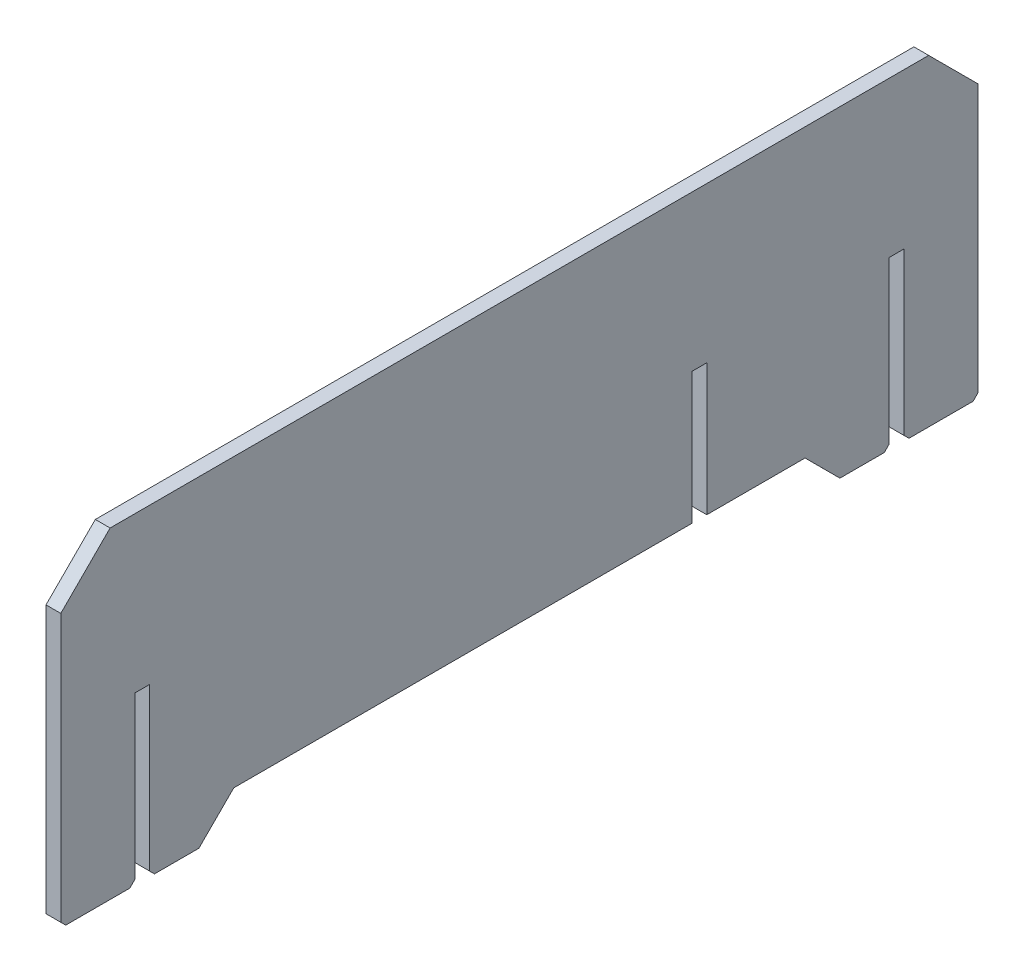
ISO-10303-21;
HEADER;
FILE_DESCRIPTION(('STEP AP214'),'2;1');
FILE_NAME('part.step','',(''),(''),'','','');
FILE_SCHEMA(('AUTOMOTIVE_DESIGN { 1 0 10303 214 1 1 1 1 }'));
ENDSEC;
DATA;
#1=APPLICATION_CONTEXT('core data for automotive mechanical design processes');
#2=APPLICATION_PROTOCOL_DEFINITION('international standard','automotive_design',2000,#1);
#3=PRODUCT_CONTEXT('',#1,'mechanical');
#4=PRODUCT('Part','Part','',(#3));
#5=PRODUCT_RELATED_PRODUCT_CATEGORY('part','',(#4));
#6=PRODUCT_DEFINITION_FORMATION('','',#4);
#7=PRODUCT_DEFINITION_CONTEXT('part definition',#1,'design');
#8=PRODUCT_DEFINITION('design','',#6,#7);
#9=PRODUCT_DEFINITION_SHAPE('','',#8);
#10=(LENGTH_UNIT() NAMED_UNIT(*) SI_UNIT(.MILLI.,.METRE.));
#11=(NAMED_UNIT(*) PLANE_ANGLE_UNIT() SI_UNIT($,.RADIAN.));
#12=(NAMED_UNIT(*) SI_UNIT($,.STERADIAN.) SOLID_ANGLE_UNIT());
#13=UNCERTAINTY_MEASURE_WITH_UNIT(LENGTH_MEASURE(1.E-05),#10,'distance_accuracy_value','');
#14=(GEOMETRIC_REPRESENTATION_CONTEXT(3) GLOBAL_UNCERTAINTY_ASSIGNED_CONTEXT((#13)) GLOBAL_UNIT_ASSIGNED_CONTEXT((#10,
#11,#12)) REPRESENTATION_CONTEXT('',''));
#15=CARTESIAN_POINT('',(0.,0.,0.));
#16=DIRECTION('',(0.,0.,1.));
#17=DIRECTION('',(1.,0.,0.));
#18=AXIS2_PLACEMENT_3D('',#15,#16,#17);
#19=CARTESIAN_POINT('',(0.,-126.588137805294,-251.318929109409));
#20=DIRECTION('',(0.,-1.,0.));
#21=DIRECTION('',(0.,0.,-1.));
#22=AXIS2_PLACEMENT_3D('',#19,#20,#21);
#23=PLANE('',#22);
#24=DIRECTION('',(0.,0.,1.));
#25=VECTOR('',#24,1.);
#26=CARTESIAN_POINT('',(-219.127859803154,-126.588137805294,-251.318929109409));
#27=LINE('',#26,#25);
#28=CARTESIAN_POINT('',(-219.127859803154,-126.588137805294,-12.9999996389794));
#29=VERTEX_POINT('',#28);
#30=CARTESIAN_POINT('',(-219.127859803154,-126.588137805294,-4.00000000000007));
#31=VERTEX_POINT('',#30);
#32=EDGE_CURVE('E354',#29,#31,#27,.T.);
#33=ORIENTED_EDGE('',*,*,#32,.T.);
#34=DIRECTION('',(-1.,0.,0.));
#35=VECTOR('',#34,1.);
#36=CARTESIAN_POINT('',(0.,-126.588137805294,-4.));
#37=LINE('',#36,#35);
#38=CARTESIAN_POINT('',(-222.127859803154,-126.588137805294,-4.00000000000003));
#39=VERTEX_POINT('',#38);
#40=EDGE_CURVE('E417',#31,#39,#37,.T.);
#41=ORIENTED_EDGE('',*,*,#40,.T.);
#42=DIRECTION('',(0.,0.,1.));
#43=VECTOR('',#42,1.);
#44=CARTESIAN_POINT('',(-222.127859803154,-126.588137805294,-251.318929109409));
#45=LINE('',#44,#43);
#46=CARTESIAN_POINT('',(-222.127859803154,-126.588137805294,-12.9999996389794));
#47=VERTEX_POINT('',#46);
#48=EDGE_CURVE('E359',#47,#39,#45,.T.);
#49=ORIENTED_EDGE('',*,*,#48,.F.);
#50=DIRECTION('',(1.,0.,0.));
#51=VECTOR('',#50,1.);
#52=CARTESIAN_POINT('',(-222.128859803154,-126.588137805294,-12.9999996389794));
#53=LINE('',#52,#51);
#54=EDGE_CURVE('E296',#47,#29,#53,.T.);
#55=ORIENTED_EDGE('',*,*,#54,.T.);
#56=EDGE_LOOP('',(#33,#41,#49,#55));
#57=FACE_BOUND('',#56,.T.);
#58=ADVANCED_FACE('F35',(#57),#23,.T.);
#59=CARTESIAN_POINT('',(-222.127859803154,-126.588137805294,-170.));
#60=VERTEX_POINT('',#59);
#61=CARTESIAN_POINT('',(-222.127859803154,-126.588137805294,-157.));
#62=VERTEX_POINT('',#61);
#63=EDGE_CURVE('E358',#60,#62,#45,.T.);
#64=ORIENTED_EDGE('',*,*,#63,.F.);
#65=DIRECTION('',(1.,0.,0.));
#66=VECTOR('',#65,1.);
#67=CARTESIAN_POINT('',(0.,-126.588137805294,-170.));
#68=LINE('',#67,#66);
#69=CARTESIAN_POINT('',(-219.127859803154,-126.588137805294,-170.));
#70=VERTEX_POINT('',#69);
#71=EDGE_CURVE('E384',#60,#70,#68,.T.);
#72=ORIENTED_EDGE('',*,*,#71,.T.);
#73=CARTESIAN_POINT('',(-219.127859803154,-126.588137805294,-157.));
#74=VERTEX_POINT('',#73);
#75=EDGE_CURVE('E345',#70,#74,#27,.T.);
#76=ORIENTED_EDGE('',*,*,#75,.T.);
#77=DIRECTION('',(-1.,0.,0.));
#78=VECTOR('',#77,1.);
#79=CARTESIAN_POINT('',(0.,-126.588137805294,-157.));
#80=LINE('',#79,#78);
#81=EDGE_CURVE('E381',#74,#62,#80,.T.);
#82=ORIENTED_EDGE('',*,*,#81,.T.);
#83=EDGE_LOOP('',(#64,#72,#76,#82));
#84=FACE_BOUND('',#83,.T.);
#85=ADVANCED_FACE('F478',(#84),#23,.T.);
#86=CARTESIAN_POINT('',(-219.127859803154,0.,-251.318929109409));
#87=DIRECTION('',(-1.,0.,0.));
#88=DIRECTION('',(0.,0.,1.));
#89=AXIS2_PLACEMENT_3D('',#86,#87,#88);
#90=PLANE('',#89);
#91=ORIENTED_EDGE('',*,*,#75,.F.);
#92=DIRECTION('',(0.,-0.707106781186557,0.707106781186538));
#93=VECTOR('',#92,1.);
#94=CARTESIAN_POINT('',(-219.127859803154,-126.588137805294,-170.));
#95=LINE('',#94,#93);
#96=CARTESIAN_POINT('',(-219.127859803154,-125.588137805293,-171.));
#97=VERTEX_POINT('',#96);
#98=EDGE_CURVE('E397',#70,#97,#95,.F.);
#99=ORIENTED_EDGE('',*,*,#98,.T.);
#100=DIRECTION('',(0.,-1.,0.));
#101=VECTOR('',#100,1.);
#102=CARTESIAN_POINT('',(-219.127859803154,0.,-171.));
#103=LINE('',#102,#101);
#104=CARTESIAN_POINT('',(-219.127859803154,-71.3381378052935,-171.));
#105=VERTEX_POINT('',#104);
#106=EDGE_CURVE('E346',#105,#97,#103,.T.);
#107=ORIENTED_EDGE('',*,*,#106,.F.);
#108=DIRECTION('',(0.,0.707106781186548,0.707106781186548));
#109=VECTOR('',#108,1.);
#110=CARTESIAN_POINT('',(-219.127859803154,-71.3381378052935,-171.));
#111=LINE('',#110,#109);
#112=CARTESIAN_POINT('',(-219.127859803154,-61.3381378052935,-161.));
#113=VERTEX_POINT('',#112);
#114=EDGE_CURVE('E368',#105,#113,#111,.T.);
#115=ORIENTED_EDGE('',*,*,#114,.T.);
#116=DIRECTION('',(0.,0.,1.));
#117=VECTOR('',#116,1.);
#118=CARTESIAN_POINT('',(-219.127859803154,-61.3381378052935,-251.318929109409));
#119=LINE('',#118,#117);
#120=CARTESIAN_POINT('',(-219.127859803154,-61.3381378052935,5.00000000000005));
#121=VERTEX_POINT('',#120);
#122=EDGE_CURVE('E340',#113,#121,#119,.T.);
#123=ORIENTED_EDGE('',*,*,#122,.T.);
#124=DIRECTION('',(0.,-0.707106781186548,0.707106781186547));
#125=VECTOR('',#124,1.);
#126=CARTESIAN_POINT('',(-219.127859803154,-61.3381378052935,5.));
#127=LINE('',#126,#125);
#128=CARTESIAN_POINT('',(-219.127859803154,-71.3381378052935,15.));
#129=VERTEX_POINT('',#128);
#130=EDGE_CURVE('E370',#121,#129,#127,.T.);
#131=ORIENTED_EDGE('',*,*,#130,.T.);
#132=DIRECTION('',(0.,-1.,0.));
#133=VECTOR('',#132,1.);
#134=CARTESIAN_POINT('',(-219.127859803154,0.,15.));
#135=LINE('',#134,#133);
#136=CARTESIAN_POINT('',(-219.127859803154,-125.588137805293,15.));
#137=VERTEX_POINT('',#136);
#138=EDGE_CURVE('E334',#129,#137,#135,.T.);
#139=ORIENTED_EDGE('',*,*,#138,.T.);
#140=DIRECTION('',(0.,0.707106781186562,0.707106781186533));
#141=VECTOR('',#140,1.);
#142=CARTESIAN_POINT('',(-219.127859803154,-125.588137805293,15.));
#143=LINE('',#142,#141);
#144=CARTESIAN_POINT('',(-219.127859803154,-126.588137805294,14.));
#145=VERTEX_POINT('',#144);
#146=EDGE_CURVE('E387',#137,#145,#143,.F.);
#147=ORIENTED_EDGE('',*,*,#146,.T.);
#148=CARTESIAN_POINT('',(-219.127859803154,-126.588137805293,0.999999999999876));
#149=VERTEX_POINT('',#148);
#150=EDGE_CURVE('E351',#149,#145,#27,.T.);
#151=ORIENTED_EDGE('',*,*,#150,.F.);
#152=DIRECTION('',(0.,-0.707106781186547,0.707106781186549));
#153=VECTOR('',#152,1.);
#154=CARTESIAN_POINT('',(-219.127859803154,-126.588137805294,1.));
#155=LINE('',#154,#153);
#156=CARTESIAN_POINT('',(-219.127859803154,-125.588137805294,0.));
#157=VERTEX_POINT('',#156);
#158=EDGE_CURVE('E389',#149,#157,#155,.F.);
#159=ORIENTED_EDGE('',*,*,#158,.T.);
#160=DIRECTION('',(0.,1.,0.));
#161=VECTOR('',#160,1.);
#162=CARTESIAN_POINT('',(-219.127859803154,0.,0.));
#163=LINE('',#162,#161);
#164=CARTESIAN_POINT('',(-219.127859803154,-92.8220322925565,0.));
#165=VERTEX_POINT('',#164);
#166=EDGE_CURVE('E323',#157,#165,#163,.T.);
#167=ORIENTED_EDGE('',*,*,#166,.T.);
#168=DIRECTION('',(0.,0.,1.));
#169=VECTOR('',#168,1.);
#170=CARTESIAN_POINT('',(-219.127859803154,-92.8220322925565,0.));
#171=LINE('',#170,#169);
#172=CARTESIAN_POINT('',(-219.127859803154,-92.8220322925565,-3.));
#173=VERTEX_POINT('',#172);
#174=EDGE_CURVE('E320',#173,#165,#171,.T.);
#175=ORIENTED_EDGE('',*,*,#174,.F.);
#176=DIRECTION('',(0.,-1.,0.));
#177=VECTOR('',#176,1.);
#178=CARTESIAN_POINT('',(-219.127859803154,0.,-3.));
#179=LINE('',#178,#177);
#180=CARTESIAN_POINT('',(-219.127859803154,-125.588137805293,-2.99999999999999));
#181=VERTEX_POINT('',#180);
#182=EDGE_CURVE('E317',#173,#181,#179,.T.);
#183=ORIENTED_EDGE('',*,*,#182,.T.);
#184=DIRECTION('',(0.,0.707106781186548,0.707106781186548));
#185=VECTOR('',#184,1.);
#186=CARTESIAN_POINT('',(-219.127859803154,-126.588137805294,-4.));
#187=LINE('',#186,#185);
#188=EDGE_CURVE('E391',#181,#31,#187,.F.);
#189=ORIENTED_EDGE('',*,*,#188,.T.);
#190=ORIENTED_EDGE('',*,*,#32,.F.);
#191=DIRECTION('',(0.,0.706916692270735,-0.707296819015188));
#192=VECTOR('',#191,1.);
#193=CARTESIAN_POINT('',(-219.127859803154,-69.8280934322864,-69.790565303905));
#194=LINE('',#193,#192);
#195=CARTESIAN_POINT('',(-219.127859803154,-119.514382091441,-20.077559087564));
#196=VERTEX_POINT('',#195);
#197=EDGE_CURVE('E288',#29,#196,#194,.T.);
#198=ORIENTED_EDGE('',*,*,#197,.T.);
#199=DIRECTION('',(0.,0.,-1.));
#200=VECTOR('',#199,1.);
#201=CARTESIAN_POINT('',(-219.127859803154,-119.514382091441,0.));
#202=LINE('',#201,#200);
#203=CARTESIAN_POINT('',(-219.127859803154,-119.514382091441,-113.));
#204=VERTEX_POINT('',#203);
#205=EDGE_CURVE('E279',#196,#204,#202,.T.);
#206=ORIENTED_EDGE('',*,*,#205,.T.);
#207=DIRECTION('',(0.,1.,0.));
#208=VECTOR('',#207,1.);
#209=CARTESIAN_POINT('',(-219.127859803154,0.,-113.));
#210=LINE('',#209,#208);
#211=CARTESIAN_POINT('',(-219.127859803154,-92.8220322925565,-113.));
#212=VERTEX_POINT('',#211);
#213=EDGE_CURVE('E285',#204,#212,#210,.T.);
#214=ORIENTED_EDGE('',*,*,#213,.T.);
#215=DIRECTION('',(0.,0.,-1.));
#216=VECTOR('',#215,1.);
#217=CARTESIAN_POINT('',(-219.127859803154,-92.8220322925565,0.));
#218=LINE('',#217,#216);
#219=CARTESIAN_POINT('',(-219.127859803154,-92.8220322925565,-116.));
#220=VERTEX_POINT('',#219);
#221=EDGE_CURVE('E282',#212,#220,#218,.T.);
#222=ORIENTED_EDGE('',*,*,#221,.T.);
#223=DIRECTION('',(0.,-1.,0.));
#224=VECTOR('',#223,1.);
#225=CARTESIAN_POINT('',(-219.127859803154,0.,-116.));
#226=LINE('',#225,#224);
#227=CARTESIAN_POINT('',(-219.127859803154,-119.514382091441,-116.));
#228=VERTEX_POINT('',#227);
#229=EDGE_CURVE('E278',#220,#228,#226,.T.);
#230=ORIENTED_EDGE('',*,*,#229,.T.);
#231=CARTESIAN_POINT('',(-219.127859803154,-119.514382091441,-135.930045976835));
#232=VERTEX_POINT('',#231);
#233=EDGE_CURVE('E275',#228,#232,#202,.T.);
#234=ORIENTED_EDGE('',*,*,#233,.T.);
#235=DIRECTION('',(0.,-0.707296819015189,-0.706916692270734));
#236=VECTOR('',#235,1.);
#237=CARTESIAN_POINT('',(-219.127859803154,8.23994641535119,-8.24437724014228));
#238=LINE('',#237,#236);
#239=CARTESIAN_POINT('',(-219.127859803154,-126.588137805294,-143.));
#240=VERTEX_POINT('',#239);
#241=EDGE_CURVE('E272',#232,#240,#238,.T.);
#242=ORIENTED_EDGE('',*,*,#241,.T.);
#243=CARTESIAN_POINT('',(-219.127859803154,-126.588137805294,-152.));
#244=VERTEX_POINT('',#243);
#245=EDGE_CURVE('E355',#244,#240,#27,.T.);
#246=ORIENTED_EDGE('',*,*,#245,.F.);
#247=DIRECTION('',(0.,-0.707106781186538,0.707106781186557));
#248=VECTOR('',#247,1.);
#249=CARTESIAN_POINT('',(-219.127859803154,-126.588137805294,-152.));
#250=LINE('',#249,#248);
#251=CARTESIAN_POINT('',(-219.127859803154,-125.588137805294,-153.));
#252=VERTEX_POINT('',#251);
#253=EDGE_CURVE('E395',#244,#252,#250,.F.);
#254=ORIENTED_EDGE('',*,*,#253,.T.);
#255=DIRECTION('',(0.,1.,0.));
#256=VECTOR('',#255,1.);
#257=CARTESIAN_POINT('',(-219.127859803154,0.,-153.));
#258=LINE('',#257,#256);
#259=CARTESIAN_POINT('',(-219.127859803154,-92.8220322925565,-153.));
#260=VERTEX_POINT('',#259);
#261=EDGE_CURVE('E233',#252,#260,#258,.T.);
#262=ORIENTED_EDGE('',*,*,#261,.T.);
#263=DIRECTION('',(0.,0.,-1.));
#264=VECTOR('',#263,1.);
#265=CARTESIAN_POINT('',(-219.127859803154,-92.8220322925565,0.));
#266=LINE('',#265,#264);
#267=CARTESIAN_POINT('',(-219.127859803154,-92.8220322925565,-156.));
#268=VERTEX_POINT('',#267);
#269=EDGE_CURVE('E226',#260,#268,#266,.T.);
#270=ORIENTED_EDGE('',*,*,#269,.T.);
#271=DIRECTION('',(0.,-1.,0.));
#272=VECTOR('',#271,1.);
#273=CARTESIAN_POINT('',(-219.127859803154,0.,-156.));
#274=LINE('',#273,#272);
#275=CARTESIAN_POINT('',(-219.127859803154,-125.588137805293,-156.));
#276=VERTEX_POINT('',#275);
#277=EDGE_CURVE('E236',#268,#276,#274,.T.);
#278=ORIENTED_EDGE('',*,*,#277,.T.);
#279=DIRECTION('',(0.,0.707106781186548,0.707106781186548));
#280=VECTOR('',#279,1.);
#281=CARTESIAN_POINT('',(-219.127859803154,-126.588137805294,-157.));
#282=LINE('',#281,#280);
#283=EDGE_CURVE('E393',#276,#74,#282,.F.);
#284=ORIENTED_EDGE('',*,*,#283,.T.);
#285=EDGE_LOOP('',(#91,#99,#107,#115,#123,#131,#139,#147,#151,#159,#167,#175,#183,#189,#190,
#198,#206,#214,#222,#230,#234,#242,#246,#254,#262,#270,#278,#284));
#286=FACE_BOUND('',#285,.T.);
#287=ADVANCED_FACE('F245',(#286),#90,.F.);
#288=CARTESIAN_POINT('',(-222.127859803154,0.,-251.318929109409));
#289=DIRECTION('',(-1.,0.,0.));
#290=DIRECTION('',(0.,0.,1.));
#291=AXIS2_PLACEMENT_3D('',#288,#289,#290);
#292=PLANE('',#291);
#293=DIRECTION('',(0.,-1.,0.));
#294=VECTOR('',#293,1.);
#295=CARTESIAN_POINT('',(-222.127859803154,0.,-171.));
#296=LINE('',#295,#294);
#297=CARTESIAN_POINT('',(-222.127859803154,-71.3381378052935,-171.));
#298=VERTEX_POINT('',#297);
#299=CARTESIAN_POINT('',(-222.127859803154,-125.588137805293,-171.));
#300=VERTEX_POINT('',#299);
#301=EDGE_CURVE('E341',#298,#300,#296,.T.);
#302=ORIENTED_EDGE('',*,*,#301,.T.);
#303=DIRECTION('',(0.,0.707106781186557,-0.707106781186538));
#304=VECTOR('',#303,1.);
#305=CARTESIAN_POINT('',(-222.127859803154,-22.6346043479405,-273.95353345735));
#306=LINE('',#305,#304);
#307=EDGE_CURVE('E410',#300,#60,#306,.F.);
#308=ORIENTED_EDGE('',*,*,#307,.T.);
#309=ORIENTED_EDGE('',*,*,#63,.T.);
#310=DIRECTION('',(0.,-0.707106781186548,-0.707106781186548));
#311=VECTOR('',#310,1.);
#312=CARTESIAN_POINT('',(-222.127859803154,-110.453533457351,-140.865395652058));
#313=LINE('',#312,#311);
#314=CARTESIAN_POINT('',(-222.127859803154,-125.588137805294,-156.));
#315=VERTEX_POINT('',#314);
#316=EDGE_CURVE('E407',#62,#315,#313,.F.);
#317=ORIENTED_EDGE('',*,*,#316,.T.);
#318=DIRECTION('',(0.,-1.,0.));
#319=VECTOR('',#318,1.);
#320=CARTESIAN_POINT('',(-222.127859803154,0.,-156.));
#321=LINE('',#320,#319);
#322=CARTESIAN_POINT('',(-222.127859803154,-92.8220322925565,-156.));
#323=VERTEX_POINT('',#322);
#324=EDGE_CURVE('E251',#323,#315,#321,.T.);
#325=ORIENTED_EDGE('',*,*,#324,.F.);
#326=DIRECTION('',(0.,0.,-1.));
#327=VECTOR('',#326,1.);
#328=CARTESIAN_POINT('',(-222.127859803154,-92.8220322925565,0.));
#329=LINE('',#328,#327);
#330=CARTESIAN_POINT('',(-222.127859803154,-92.8220322925565,-153.));
#331=VERTEX_POINT('',#330);
#332=EDGE_CURVE('E228',#331,#323,#329,.T.);
#333=ORIENTED_EDGE('',*,*,#332,.F.);
#334=DIRECTION('',(0.,1.,0.));
#335=VECTOR('',#334,1.);
#336=CARTESIAN_POINT('',(-222.127859803154,0.,-153.));
#337=LINE('',#336,#335);
#338=CARTESIAN_POINT('',(-222.127859803154,-125.588137805293,-153.));
#339=VERTEX_POINT('',#338);
#340=EDGE_CURVE('E242',#339,#331,#337,.T.);
#341=ORIENTED_EDGE('',*,*,#340,.F.);
#342=DIRECTION('',(0.,0.707106781186538,-0.707106781186557));
#343=VECTOR('',#342,1.);
#344=CARTESIAN_POINT('',(-222.127859803154,-13.634604347944,-264.953533457353));
#345=LINE('',#344,#343);
#346=CARTESIAN_POINT('',(-222.127859803154,-126.588137805294,-152.));
#347=VERTEX_POINT('',#346);
#348=EDGE_CURVE('E50',#339,#347,#345,.F.);
#349=ORIENTED_EDGE('',*,*,#348,.T.);
#350=CARTESIAN_POINT('',(-222.127859803154,-126.588137805294,-143.));
#351=VERTEX_POINT('',#350);
#352=EDGE_CURVE('E356',#347,#351,#45,.T.);
#353=ORIENTED_EDGE('',*,*,#352,.T.);
#354=DIRECTION('',(0.,-0.707296819015189,-0.706916692270734));
#355=VECTOR('',#354,1.);
#356=CARTESIAN_POINT('',(-222.127859803154,8.23994641535119,-8.24437724014228));
#357=LINE('',#356,#355);
#358=CARTESIAN_POINT('',(-222.127859803154,-119.514382091441,-135.930045976835));
#359=VERTEX_POINT('',#358);
#360=EDGE_CURVE('E269',#359,#351,#357,.T.);
#361=ORIENTED_EDGE('',*,*,#360,.F.);
#362=DIRECTION('',(0.,0.,-1.));
#363=VECTOR('',#362,1.);
#364=CARTESIAN_POINT('',(-222.127859803154,-119.514382091441,0.));
#365=LINE('',#364,#363);
#366=CARTESIAN_POINT('',(-222.127859803154,-119.514382091441,-116.));
#367=VERTEX_POINT('',#366);
#368=EDGE_CURVE('E295',#367,#359,#365,.T.);
#369=ORIENTED_EDGE('',*,*,#368,.F.);
#370=DIRECTION('',(0.,-1.,0.));
#371=VECTOR('',#370,1.);
#372=CARTESIAN_POINT('',(-222.127859803154,0.,-116.));
#373=LINE('',#372,#371);
#374=CARTESIAN_POINT('',(-222.127859803154,-92.8220322925565,-116.));
#375=VERTEX_POINT('',#374);
#376=EDGE_CURVE('E254',#375,#367,#373,.T.);
#377=ORIENTED_EDGE('',*,*,#376,.F.);
#378=DIRECTION('',(0.,0.,-1.));
#379=VECTOR('',#378,1.);
#380=CARTESIAN_POINT('',(-222.127859803154,-92.8220322925565,0.));
#381=LINE('',#380,#379);
#382=CARTESIAN_POINT('',(-222.127859803154,-92.8220322925565,-113.));
#383=VERTEX_POINT('',#382);
#384=EDGE_CURVE('E257',#383,#375,#381,.T.);
#385=ORIENTED_EDGE('',*,*,#384,.F.);
#386=DIRECTION('',(0.,1.,0.));
#387=VECTOR('',#386,1.);
#388=CARTESIAN_POINT('',(-222.127859803154,0.,-113.));
#389=LINE('',#388,#387);
#390=CARTESIAN_POINT('',(-222.127859803154,-119.514382091441,-113.));
#391=VERTEX_POINT('',#390);
#392=EDGE_CURVE('E260',#391,#383,#389,.T.);
#393=ORIENTED_EDGE('',*,*,#392,.F.);
#394=DIRECTION('',(0.,0.,-1.));
#395=VECTOR('',#394,1.);
#396=CARTESIAN_POINT('',(-222.127859803154,-119.514382091441,0.));
#397=LINE('',#396,#395);
#398=CARTESIAN_POINT('',(-222.127859803154,-119.514382091441,-20.077559087564));
#399=VERTEX_POINT('',#398);
#400=EDGE_CURVE('E263',#399,#391,#397,.T.);
#401=ORIENTED_EDGE('',*,*,#400,.F.);
#402=DIRECTION('',(0.,0.706916692270735,-0.707296819015188));
#403=VECTOR('',#402,1.);
#404=CARTESIAN_POINT('',(-222.127859803154,-69.8280934322864,-69.790565303905));
#405=LINE('',#404,#403);
#406=EDGE_CURVE('E266',#47,#399,#405,.T.);
#407=ORIENTED_EDGE('',*,*,#406,.F.);
#408=ORIENTED_EDGE('',*,*,#48,.T.);
#409=DIRECTION('',(0.,-0.707106781186548,-0.707106781186548));
#410=VECTOR('',#409,1.);
#411=CARTESIAN_POINT('',(-222.127859803154,-186.953533457351,-64.3653956520577));
#412=LINE('',#411,#410);
#413=CARTESIAN_POINT('',(-222.127859803154,-125.588137805294,-3.));
#414=VERTEX_POINT('',#413);
#415=EDGE_CURVE('E405',#39,#414,#412,.F.);
#416=ORIENTED_EDGE('',*,*,#415,.T.);
#417=DIRECTION('',(0.,-1.,0.));
#418=VECTOR('',#417,1.);
#419=CARTESIAN_POINT('',(-222.127859803154,0.,-3.));
#420=LINE('',#419,#418);
#421=CARTESIAN_POINT('',(-222.127859803154,-92.8220322925565,-3.));
#422=VERTEX_POINT('',#421);
#423=EDGE_CURVE('E314',#422,#414,#420,.T.);
#424=ORIENTED_EDGE('',*,*,#423,.F.);
#425=DIRECTION('',(0.,0.,1.));
#426=VECTOR('',#425,1.);
#427=CARTESIAN_POINT('',(-222.127859803154,-92.8220322925565,0.));
#428=LINE('',#427,#426);
#429=CARTESIAN_POINT('',(-222.127859803154,-92.8220322925565,0.));
#430=VERTEX_POINT('',#429);
#431=EDGE_CURVE('E329',#422,#430,#428,.T.);
#432=ORIENTED_EDGE('',*,*,#431,.T.);
#433=DIRECTION('',(0.,1.,0.));
#434=VECTOR('',#433,1.);
#435=CARTESIAN_POINT('',(-222.127859803154,0.,0.));
#436=LINE('',#435,#434);
#437=CARTESIAN_POINT('',(-222.127859803154,-125.588137805294,0.));
#438=VERTEX_POINT('',#437);
#439=EDGE_CURVE('E312',#438,#430,#436,.T.);
#440=ORIENTED_EDGE('',*,*,#439,.F.);
#441=DIRECTION('',(0.,0.707106781186547,-0.707106781186549));
#442=VECTOR('',#441,1.);
#443=CARTESIAN_POINT('',(-222.127859803154,62.8653956520576,-188.453533457352));
#444=LINE('',#443,#442);
#445=CARTESIAN_POINT('',(-222.127859803154,-126.588137805294,0.999999999999987));
#446=VERTEX_POINT('',#445);
#447=EDGE_CURVE('E403',#438,#446,#444,.F.);
#448=ORIENTED_EDGE('',*,*,#447,.T.);
#449=CARTESIAN_POINT('',(-222.127859803154,-126.588137805293,14.0000000000001));
#450=VERTEX_POINT('',#449);
#451=EDGE_CURVE('E344',#446,#450,#45,.T.);
#452=ORIENTED_EDGE('',*,*,#451,.T.);
#453=DIRECTION('',(0.,-0.707106781186562,-0.707106781186533));
#454=VECTOR('',#453,1.);
#455=CARTESIAN_POINT('',(-222.127859803154,-195.953533457349,-55.3653956520522));
#456=LINE('',#455,#454);
#457=CARTESIAN_POINT('',(-222.127859803154,-125.588137805293,15.));
#458=VERTEX_POINT('',#457);
#459=EDGE_CURVE('E401',#450,#458,#456,.F.);
#460=ORIENTED_EDGE('',*,*,#459,.T.);
#461=DIRECTION('',(0.,-1.,0.));
#462=VECTOR('',#461,1.);
#463=CARTESIAN_POINT('',(-222.127859803154,0.,15.));
#464=LINE('',#463,#462);
#465=CARTESIAN_POINT('',(-222.127859803154,-71.3381378052936,15.));
#466=VERTEX_POINT('',#465);
#467=EDGE_CURVE('E337',#466,#458,#464,.T.);
#468=ORIENTED_EDGE('',*,*,#467,.F.);
#469=DIRECTION('',(0.,0.707106781186548,-0.707106781186547));
#470=VECTOR('',#469,1.);
#471=CARTESIAN_POINT('',(-222.127859803154,97.4903956520578,-153.828533457351));
#472=LINE('',#471,#470);
#473=CARTESIAN_POINT('',(-222.127859803154,-61.3381378052935,4.99999999999999));
#474=VERTEX_POINT('',#473);
#475=EDGE_CURVE('E376',#466,#474,#472,.T.);
#476=ORIENTED_EDGE('',*,*,#475,.T.);
#477=DIRECTION('',(0.,0.,1.));
#478=VECTOR('',#477,1.);
#479=CARTESIAN_POINT('',(-222.127859803154,-61.3381378052935,-251.318929109409));
#480=LINE('',#479,#478);
#481=CARTESIAN_POINT('',(-222.127859803154,-61.3381378052935,-161.));
#482=VERTEX_POINT('',#481);
#483=EDGE_CURVE('E350',#482,#474,#480,.T.);
#484=ORIENTED_EDGE('',*,*,#483,.F.);
#485=DIRECTION('',(0.,-0.707106781186548,-0.707106781186548));
#486=VECTOR('',#485,1.);
#487=CARTESIAN_POINT('',(-222.127859803154,-75.8285334573513,-175.490395652058));
#488=LINE('',#487,#486);
#489=EDGE_CURVE('E374',#482,#298,#488,.T.);
#490=ORIENTED_EDGE('',*,*,#489,.T.);
#491=EDGE_LOOP('',(#302,#308,#309,#317,#325,#333,#341,#349,#353,#361,#369,#377,#385,#393,#401,
#407,#408,#416,#424,#432,#440,#448,#452,#460,#468,#476,#484,#490));
#492=FACE_BOUND('',#491,.T.);
#493=ADVANCED_FACE('F434',(#492),#292,.T.);
#494=ORIENTED_EDGE('',*,*,#352,.F.);
#495=DIRECTION('',(1.,0.,0.));
#496=VECTOR('',#495,1.);
#497=CARTESIAN_POINT('',(0.,-126.588137805294,-152.));
#498=LINE('',#497,#496);
#499=EDGE_CURVE('E412',#347,#244,#498,.T.);
#500=ORIENTED_EDGE('',*,*,#499,.T.);
#501=ORIENTED_EDGE('',*,*,#245,.T.);
#502=DIRECTION('',(1.,0.,0.));
#503=VECTOR('',#502,1.);
#504=CARTESIAN_POINT('',(-222.128859803154,-126.588137805294,-143.));
#505=LINE('',#504,#503);
#506=EDGE_CURVE('E292',#351,#240,#505,.T.);
#507=ORIENTED_EDGE('',*,*,#506,.F.);
#508=EDGE_LOOP('',(#494,#500,#501,#507));
#509=FACE_BOUND('',#508,.T.);
#510=ADVANCED_FACE('F511',(#509),#23,.T.);
#511=ORIENTED_EDGE('',*,*,#451,.F.);
#512=DIRECTION('',(1.,0.,0.));
#513=VECTOR('',#512,1.);
#514=CARTESIAN_POINT('',(0.,-126.588137805294,1.));
#515=LINE('',#514,#513);
#516=EDGE_CURVE('E424',#446,#149,#515,.T.);
#517=ORIENTED_EDGE('',*,*,#516,.T.);
#518=ORIENTED_EDGE('',*,*,#150,.T.);
#519=DIRECTION('',(-1.,0.,0.));
#520=VECTOR('',#519,1.);
#521=CARTESIAN_POINT('',(0.,-126.588137805294,14.));
#522=LINE('',#521,#520);
#523=EDGE_CURVE('E422',#145,#450,#522,.T.);
#524=ORIENTED_EDGE('',*,*,#523,.T.);
#525=EDGE_LOOP('',(#511,#517,#518,#524));
#526=FACE_BOUND('',#525,.T.);
#527=ADVANCED_FACE('F442',(#526),#23,.T.);
#528=CARTESIAN_POINT('',(0.,-61.3381378052935,-251.318929109409));
#529=DIRECTION('',(0.,-1.,0.));
#530=DIRECTION('',(0.,0.,-1.));
#531=AXIS2_PLACEMENT_3D('',#528,#529,#530);
#532=PLANE('',#531);
#533=ORIENTED_EDGE('',*,*,#483,.T.);
#534=DIRECTION('',(1.,0.,0.));
#535=VECTOR('',#534,1.);
#536=CARTESIAN_POINT('',(-219.127859803154,-61.3381378052935,5.));
#537=LINE('',#536,#535);
#538=EDGE_CURVE('E365',#474,#121,#537,.T.);
#539=ORIENTED_EDGE('',*,*,#538,.T.);
#540=ORIENTED_EDGE('',*,*,#122,.F.);
#541=DIRECTION('',(-1.,0.,0.));
#542=VECTOR('',#541,1.);
#543=CARTESIAN_POINT('',(-222.127859803154,-61.3381378052935,-161.));
#544=LINE('',#543,#542);
#545=EDGE_CURVE('E349',#113,#482,#544,.T.);
#546=ORIENTED_EDGE('',*,*,#545,.T.);
#547=EDGE_LOOP('',(#533,#539,#540,#546));
#548=FACE_BOUND('',#547,.T.);
#549=ADVANCED_FACE('F459',(#548),#532,.F.);
#550=CARTESIAN_POINT('',(0.,0.,-171.));
#551=DIRECTION('',(0.,0.,-1.));
#552=DIRECTION('',(-1.,0.,0.));
#553=AXIS2_PLACEMENT_3D('',#550,#551,#552);
#554=PLANE('',#553);
#555=ORIENTED_EDGE('',*,*,#106,.T.);
#556=DIRECTION('',(-1.,0.,0.));
#557=VECTOR('',#556,1.);
#558=CARTESIAN_POINT('',(0.,-125.588137805293,-171.));
#559=LINE('',#558,#557);
#560=EDGE_CURVE('E399',#97,#300,#559,.T.);
#561=ORIENTED_EDGE('',*,*,#560,.T.);
#562=ORIENTED_EDGE('',*,*,#301,.F.);
#563=DIRECTION('',(1.,0.,0.));
#564=VECTOR('',#563,1.);
#565=CARTESIAN_POINT('',(-219.127859803154,-71.3381378052935,-171.));
#566=LINE('',#565,#564);
#567=EDGE_CURVE('E378',#298,#105,#566,.T.);
#568=ORIENTED_EDGE('',*,*,#567,.T.);
#569=EDGE_LOOP('',(#555,#561,#562,#568));
#570=FACE_BOUND('',#569,.T.);
#571=ADVANCED_FACE('F468',(#570),#554,.T.);
#572=CARTESIAN_POINT('',(0.,0.,15.));
#573=DIRECTION('',(0.,0.,1.));
#574=DIRECTION('',(1.,0.,0.));
#575=AXIS2_PLACEMENT_3D('',#572,#573,#574);
#576=PLANE('',#575);
#577=ORIENTED_EDGE('',*,*,#467,.T.);
#578=DIRECTION('',(1.,0.,0.));
#579=VECTOR('',#578,1.);
#580=CARTESIAN_POINT('',(0.,-125.588137805293,15.));
#581=LINE('',#580,#579);
#582=EDGE_CURVE('E11',#458,#137,#581,.T.);
#583=ORIENTED_EDGE('',*,*,#582,.T.);
#584=ORIENTED_EDGE('',*,*,#138,.F.);
#585=DIRECTION('',(-1.,0.,0.));
#586=VECTOR('',#585,1.);
#587=CARTESIAN_POINT('',(-222.127859803154,-71.3381378052935,15.));
#588=LINE('',#587,#586);
#589=EDGE_CURVE('E372',#129,#466,#588,.T.);
#590=ORIENTED_EDGE('',*,*,#589,.T.);
#591=EDGE_LOOP('',(#577,#583,#584,#590));
#592=FACE_BOUND('',#591,.T.);
#593=ADVANCED_FACE('F449',(#592),#576,.T.);
#594=CARTESIAN_POINT('',(-222.128859803154,0.,-3.));
#595=DIRECTION('',(0.,0.,1.));
#596=DIRECTION('',(1.,0.,0.));
#597=AXIS2_PLACEMENT_3D('',#594,#595,#596);
#598=PLANE('',#597);
#599=ORIENTED_EDGE('',*,*,#423,.T.);
#600=DIRECTION('',(1.,0.,0.));
#601=VECTOR('',#600,1.);
#602=CARTESIAN_POINT('',(-222.128859803154,-125.588137805294,-3.));
#603=LINE('',#602,#601);
#604=EDGE_CURVE('E420',#414,#181,#603,.T.);
#605=ORIENTED_EDGE('',*,*,#604,.T.);
#606=ORIENTED_EDGE('',*,*,#182,.F.);
#607=DIRECTION('',(1.,0.,0.));
#608=VECTOR('',#607,1.);
#609=CARTESIAN_POINT('',(-222.128859803154,-92.8220322925565,-3.));
#610=LINE('',#609,#608);
#611=EDGE_CURVE('E325',#422,#173,#610,.T.);
#612=ORIENTED_EDGE('',*,*,#611,.F.);
#613=EDGE_LOOP('',(#599,#605,#606,#612));
#614=FACE_BOUND('',#613,.T.);
#615=ADVANCED_FACE('F493',(#614),#598,.T.);
#616=CARTESIAN_POINT('',(-222.128859803154,0.,0.));
#617=DIRECTION('',(0.,0.,-1.));
#618=DIRECTION('',(-1.,0.,0.));
#619=AXIS2_PLACEMENT_3D('',#616,#617,#618);
#620=PLANE('',#619);
#621=ORIENTED_EDGE('',*,*,#166,.F.);
#622=DIRECTION('',(-1.,0.,0.));
#623=VECTOR('',#622,1.);
#624=CARTESIAN_POINT('',(-222.128859803154,-125.588137805294,0.));
#625=LINE('',#624,#623);
#626=EDGE_CURVE('E43',#157,#438,#625,.T.);
#627=ORIENTED_EDGE('',*,*,#626,.T.);
#628=ORIENTED_EDGE('',*,*,#439,.T.);
#629=DIRECTION('',(1.,0.,0.));
#630=VECTOR('',#629,1.);
#631=CARTESIAN_POINT('',(-222.128859803154,-92.8220322925565,0.));
#632=LINE('',#631,#630);
#633=EDGE_CURVE('E326',#430,#165,#632,.T.);
#634=ORIENTED_EDGE('',*,*,#633,.T.);
#635=EDGE_LOOP('',(#621,#627,#628,#634));
#636=FACE_BOUND('',#635,.T.);
#637=ADVANCED_FACE('F430',(#636),#620,.T.);
#638=CARTESIAN_POINT('',(-222.128859803154,-92.8220322925565,0.));
#639=DIRECTION('',(0.,1.,0.));
#640=DIRECTION('',(0.,0.,1.));
#641=AXIS2_PLACEMENT_3D('',#638,#639,#640);
#642=PLANE('',#641);
#643=ORIENTED_EDGE('',*,*,#611,.T.);
#644=ORIENTED_EDGE('',*,*,#174,.T.);
#645=ORIENTED_EDGE('',*,*,#633,.F.);
#646=ORIENTED_EDGE('',*,*,#431,.F.);
#647=EDGE_LOOP('',(#643,#644,#645,#646));
#648=FACE_BOUND('',#647,.T.);
#649=ADVANCED_FACE('F496',(#648),#642,.F.);
#650=CARTESIAN_POINT('',(-222.128859803154,8.23994641535119,-8.24437724014228));
#651=DIRECTION('',(0.,-0.706916692270734,0.707296819015189));
#652=DIRECTION('',(0.,-0.707296819015189,-0.706916692270734));
#653=AXIS2_PLACEMENT_3D('',#650,#651,#652);
#654=PLANE('',#653);
#655=ORIENTED_EDGE('',*,*,#360,.T.);
#656=ORIENTED_EDGE('',*,*,#506,.T.);
#657=ORIENTED_EDGE('',*,*,#241,.F.);
#658=DIRECTION('',(1.,0.,0.));
#659=VECTOR('',#658,1.);
#660=CARTESIAN_POINT('',(-222.128859803154,-119.514382091441,-135.930045976835));
#661=LINE('',#660,#659);
#662=EDGE_CURVE('E291',#359,#232,#661,.T.);
#663=ORIENTED_EDGE('',*,*,#662,.F.);
#664=EDGE_LOOP('',(#655,#656,#657,#663));
#665=FACE_BOUND('',#664,.T.);
#666=ADVANCED_FACE('F498',(#665),#654,.T.);
#667=CARTESIAN_POINT('',(-222.128859803154,-69.8280934322864,-69.790565303905));
#668=DIRECTION('',(0.,-0.707296819015188,-0.706916692270735));
#669=DIRECTION('',(0.,0.706916692270735,-0.707296819015188));
#670=AXIS2_PLACEMENT_3D('',#667,#668,#669);
#671=PLANE('',#670);
#672=ORIENTED_EDGE('',*,*,#406,.T.);
#673=DIRECTION('',(1.,0.,0.));
#674=VECTOR('',#673,1.);
#675=CARTESIAN_POINT('',(-222.128859803154,-119.514382091441,-20.077559087564));
#676=LINE('',#675,#674);
#677=EDGE_CURVE('E299',#399,#196,#676,.T.);
#678=ORIENTED_EDGE('',*,*,#677,.T.);
#679=ORIENTED_EDGE('',*,*,#197,.F.);
#680=ORIENTED_EDGE('',*,*,#54,.F.);
#681=EDGE_LOOP('',(#672,#678,#679,#680));
#682=FACE_BOUND('',#681,.T.);
#683=ADVANCED_FACE('F504',(#682),#671,.T.);
#684=CARTESIAN_POINT('',(-222.128859803154,-119.514382091441,0.));
#685=DIRECTION('',(0.,-1.,0.));
#686=DIRECTION('',(0.,0.,-1.));
#687=AXIS2_PLACEMENT_3D('',#684,#685,#686);
#688=PLANE('',#687);
#689=ORIENTED_EDGE('',*,*,#400,.T.);
#690=DIRECTION('',(1.,0.,0.));
#691=VECTOR('',#690,1.);
#692=CARTESIAN_POINT('',(-222.128859803154,-119.514382091441,-113.));
#693=LINE('',#692,#691);
#694=EDGE_CURVE('E301',#391,#204,#693,.T.);
#695=ORIENTED_EDGE('',*,*,#694,.T.);
#696=ORIENTED_EDGE('',*,*,#205,.F.);
#697=ORIENTED_EDGE('',*,*,#677,.F.);
#698=EDGE_LOOP('',(#689,#695,#696,#697));
#699=FACE_BOUND('',#698,.T.);
#700=ADVANCED_FACE('F706',(#699),#688,.T.);
#701=CARTESIAN_POINT('',(-222.128859803154,0.,-113.));
#702=DIRECTION('',(0.,0.,-1.));
#703=DIRECTION('',(-1.,0.,0.));
#704=AXIS2_PLACEMENT_3D('',#701,#702,#703);
#705=PLANE('',#704);
#706=ORIENTED_EDGE('',*,*,#392,.T.);
#707=DIRECTION('',(1.,0.,0.));
#708=VECTOR('',#707,1.);
#709=CARTESIAN_POINT('',(-222.128859803154,-92.8220322925565,-113.));
#710=LINE('',#709,#708);
#711=EDGE_CURVE('E303',#383,#212,#710,.T.);
#712=ORIENTED_EDGE('',*,*,#711,.T.);
#713=ORIENTED_EDGE('',*,*,#213,.F.);
#714=ORIENTED_EDGE('',*,*,#694,.F.);
#715=EDGE_LOOP('',(#706,#712,#713,#714));
#716=FACE_BOUND('',#715,.T.);
#717=ADVANCED_FACE('F725',(#716),#705,.T.);
#718=CARTESIAN_POINT('',(-222.128859803154,-92.8220322925565,0.));
#719=DIRECTION('',(0.,-1.,0.));
#720=DIRECTION('',(0.,0.,-1.));
#721=AXIS2_PLACEMENT_3D('',#718,#719,#720);
#722=PLANE('',#721);
#723=ORIENTED_EDGE('',*,*,#384,.T.);
#724=DIRECTION('',(1.,0.,0.));
#725=VECTOR('',#724,1.);
#726=CARTESIAN_POINT('',(-222.128859803154,-92.8220322925565,-116.));
#727=LINE('',#726,#725);
#728=EDGE_CURVE('E305',#375,#220,#727,.T.);
#729=ORIENTED_EDGE('',*,*,#728,.T.);
#730=ORIENTED_EDGE('',*,*,#221,.F.);
#731=ORIENTED_EDGE('',*,*,#711,.F.);
#732=EDGE_LOOP('',(#723,#729,#730,#731));
#733=FACE_BOUND('',#732,.T.);
#734=ADVANCED_FACE('F715',(#733),#722,.T.);
#735=CARTESIAN_POINT('',(-222.128859803154,0.,-116.));
#736=DIRECTION('',(0.,0.,1.));
#737=DIRECTION('',(1.,0.,0.));
#738=AXIS2_PLACEMENT_3D('',#735,#736,#737);
#739=PLANE('',#738);
#740=ORIENTED_EDGE('',*,*,#376,.T.);
#741=DIRECTION('',(1.,0.,0.));
#742=VECTOR('',#741,1.);
#743=CARTESIAN_POINT('',(-222.128859803154,-119.514382091441,-116.));
#744=LINE('',#743,#742);
#745=EDGE_CURVE('E307',#367,#228,#744,.T.);
#746=ORIENTED_EDGE('',*,*,#745,.T.);
#747=ORIENTED_EDGE('',*,*,#229,.F.);
#748=ORIENTED_EDGE('',*,*,#728,.F.);
#749=EDGE_LOOP('',(#740,#746,#747,#748));
#750=FACE_BOUND('',#749,.T.);
#751=ADVANCED_FACE('F703',(#750),#739,.T.);
#752=ORIENTED_EDGE('',*,*,#368,.T.);
#753=ORIENTED_EDGE('',*,*,#662,.T.);
#754=ORIENTED_EDGE('',*,*,#233,.F.);
#755=ORIENTED_EDGE('',*,*,#745,.F.);
#756=EDGE_LOOP('',(#752,#753,#754,#755));
#757=FACE_BOUND('',#756,.T.);
#758=ADVANCED_FACE('F598',(#757),#688,.T.);
#759=CARTESIAN_POINT('',(-222.128859803154,0.,-153.));
#760=DIRECTION('',(0.,0.,-1.));
#761=DIRECTION('',(-1.,0.,0.));
#762=AXIS2_PLACEMENT_3D('',#759,#760,#761);
#763=PLANE('',#762);
#764=ORIENTED_EDGE('',*,*,#261,.F.);
#765=DIRECTION('',(-1.,0.,0.));
#766=VECTOR('',#765,1.);
#767=CARTESIAN_POINT('',(-222.128859803154,-125.588137805294,-153.));
#768=LINE('',#767,#766);
#769=EDGE_CURVE('E58',#252,#339,#768,.T.);
#770=ORIENTED_EDGE('',*,*,#769,.T.);
#771=ORIENTED_EDGE('',*,*,#340,.T.);
#772=DIRECTION('',(1.,0.,0.));
#773=VECTOR('',#772,1.);
#774=CARTESIAN_POINT('',(-222.128859803154,-92.8220322925565,-153.));
#775=LINE('',#774,#773);
#776=EDGE_CURVE('E232',#331,#260,#775,.T.);
#777=ORIENTED_EDGE('',*,*,#776,.T.);
#778=EDGE_LOOP('',(#764,#770,#771,#777));
#779=FACE_BOUND('',#778,.T.);
#780=ADVANCED_FACE('F529',(#779),#763,.T.);
#781=CARTESIAN_POINT('',(-222.128859803154,-92.8220322925565,0.));
#782=DIRECTION('',(0.,-1.,0.));
#783=DIRECTION('',(0.,0.,-1.));
#784=AXIS2_PLACEMENT_3D('',#781,#782,#783);
#785=PLANE('',#784);
#786=ORIENTED_EDGE('',*,*,#332,.T.);
#787=DIRECTION('',(1.,0.,0.));
#788=VECTOR('',#787,1.);
#789=CARTESIAN_POINT('',(-222.128859803154,-92.8220322925565,-156.));
#790=LINE('',#789,#788);
#791=EDGE_CURVE('E221',#323,#268,#790,.T.);
#792=ORIENTED_EDGE('',*,*,#791,.T.);
#793=ORIENTED_EDGE('',*,*,#269,.F.);
#794=ORIENTED_EDGE('',*,*,#776,.F.);
#795=EDGE_LOOP('',(#786,#792,#793,#794));
#796=FACE_BOUND('',#795,.T.);
#797=ADVANCED_FACE('F223',(#796),#785,.T.);
#798=CARTESIAN_POINT('',(-222.128859803154,0.,-156.));
#799=DIRECTION('',(0.,0.,1.));
#800=DIRECTION('',(1.,0.,0.));
#801=AXIS2_PLACEMENT_3D('',#798,#799,#800);
#802=PLANE('',#801);
#803=ORIENTED_EDGE('',*,*,#324,.T.);
#804=DIRECTION('',(1.,0.,0.));
#805=VECTOR('',#804,1.);
#806=CARTESIAN_POINT('',(-222.128859803154,-125.588137805294,-156.));
#807=LINE('',#806,#805);
#808=EDGE_CURVE('E239',#315,#276,#807,.T.);
#809=ORIENTED_EDGE('',*,*,#808,.T.);
#810=ORIENTED_EDGE('',*,*,#277,.F.);
#811=ORIENTED_EDGE('',*,*,#791,.F.);
#812=EDGE_LOOP('',(#803,#809,#810,#811));
#813=FACE_BOUND('',#812,.T.);
#814=ADVANCED_FACE('F237',(#813),#802,.T.);
#815=CARTESIAN_POINT('',(0.,-61.3381378052935,5.));
#816=DIRECTION('',(0.,0.707106781186547,0.707106781186548));
#817=DIRECTION('',(-1.,0.,0.));
#818=AXIS2_PLACEMENT_3D('',#815,#816,#817);
#819=PLANE('',#818);
#820=ORIENTED_EDGE('',*,*,#475,.F.);
#821=ORIENTED_EDGE('',*,*,#589,.F.);
#822=ORIENTED_EDGE('',*,*,#130,.F.);
#823=ORIENTED_EDGE('',*,*,#538,.F.);
#824=EDGE_LOOP('',(#820,#821,#822,#823));
#825=FACE_BOUND('',#824,.T.);
#826=ADVANCED_FACE('F456',(#825),#819,.T.);
#827=CARTESIAN_POINT('',(0.,-71.3381378052935,-171.));
#828=DIRECTION('',(0.,0.707106781186547,-0.707106781186547));
#829=DIRECTION('',(-1.,0.,0.));
#830=AXIS2_PLACEMENT_3D('',#827,#828,#829);
#831=PLANE('',#830);
#832=ORIENTED_EDGE('',*,*,#489,.F.);
#833=ORIENTED_EDGE('',*,*,#545,.F.);
#834=ORIENTED_EDGE('',*,*,#114,.F.);
#835=ORIENTED_EDGE('',*,*,#567,.F.);
#836=EDGE_LOOP('',(#832,#833,#834,#835));
#837=FACE_BOUND('',#836,.T.);
#838=ADVANCED_FACE('F465',(#837),#831,.T.);
#839=CARTESIAN_POINT('',(0.,-126.588137805294,-170.));
#840=DIRECTION('',(0.,0.707106781186538,0.707106781186557));
#841=DIRECTION('',(1.,0.,0.));
#842=AXIS2_PLACEMENT_3D('',#839,#840,#841);
#843=PLANE('',#842);
#844=ORIENTED_EDGE('',*,*,#307,.F.);
#845=ORIENTED_EDGE('',*,*,#560,.F.);
#846=ORIENTED_EDGE('',*,*,#98,.F.);
#847=ORIENTED_EDGE('',*,*,#71,.F.);
#848=EDGE_LOOP('',(#844,#845,#846,#847));
#849=FACE_BOUND('',#848,.T.);
#850=ADVANCED_FACE('F475',(#849),#843,.F.);
#851=CARTESIAN_POINT('',(0.,-126.588137805294,-152.));
#852=DIRECTION('',(0.,0.707106781186557,0.707106781186538));
#853=DIRECTION('',(1.,0.,0.));
#854=AXIS2_PLACEMENT_3D('',#851,#852,#853);
#855=PLANE('',#854);
#856=ORIENTED_EDGE('',*,*,#348,.F.);
#857=ORIENTED_EDGE('',*,*,#769,.F.);
#858=ORIENTED_EDGE('',*,*,#253,.F.);
#859=ORIENTED_EDGE('',*,*,#499,.F.);
#860=EDGE_LOOP('',(#856,#857,#858,#859));
#861=FACE_BOUND('',#860,.T.);
#862=ADVANCED_FACE('F528',(#861),#855,.F.);
#863=CARTESIAN_POINT('',(0.,-126.588137805294,-157.));
#864=DIRECTION('',(0.,0.707106781186547,-0.707106781186547));
#865=DIRECTION('',(-1.,0.,0.));
#866=AXIS2_PLACEMENT_3D('',#863,#864,#865);
#867=PLANE('',#866);
#868=ORIENTED_EDGE('',*,*,#283,.F.);
#869=ORIENTED_EDGE('',*,*,#808,.F.);
#870=ORIENTED_EDGE('',*,*,#316,.F.);
#871=ORIENTED_EDGE('',*,*,#81,.F.);
#872=EDGE_LOOP('',(#868,#869,#870,#871));
#873=FACE_BOUND('',#872,.T.);
#874=ADVANCED_FACE('F532',(#873),#867,.F.);
#875=CARTESIAN_POINT('',(0.,-126.588137805294,-4.));
#876=DIRECTION('',(0.,0.707106781186547,-0.707106781186547));
#877=DIRECTION('',(-1.,0.,0.));
#878=AXIS2_PLACEMENT_3D('',#875,#876,#877);
#879=PLANE('',#878);
#880=ORIENTED_EDGE('',*,*,#188,.F.);
#881=ORIENTED_EDGE('',*,*,#604,.F.);
#882=ORIENTED_EDGE('',*,*,#415,.F.);
#883=ORIENTED_EDGE('',*,*,#40,.F.);
#884=EDGE_LOOP('',(#880,#881,#882,#883));
#885=FACE_BOUND('',#884,.T.);
#886=ADVANCED_FACE('F488',(#885),#879,.F.);
#887=CARTESIAN_POINT('',(0.,-126.588137805294,1.));
#888=DIRECTION('',(0.,0.707106781186549,0.707106781186547));
#889=DIRECTION('',(1.,0.,0.));
#890=AXIS2_PLACEMENT_3D('',#887,#888,#889);
#891=PLANE('',#890);
#892=ORIENTED_EDGE('',*,*,#447,.F.);
#893=ORIENTED_EDGE('',*,*,#626,.F.);
#894=ORIENTED_EDGE('',*,*,#158,.F.);
#895=ORIENTED_EDGE('',*,*,#516,.F.);
#896=EDGE_LOOP('',(#892,#893,#894,#895));
#897=FACE_BOUND('',#896,.T.);
#898=ADVANCED_FACE('F439',(#897),#891,.F.);
#899=CARTESIAN_POINT('',(0.,-125.588137805293,15.));
#900=DIRECTION('',(0.,0.707106781186533,-0.707106781186562));
#901=DIRECTION('',(1.,0.,0.));
#902=AXIS2_PLACEMENT_3D('',#899,#900,#901);
#903=PLANE('',#902);
#904=ORIENTED_EDGE('',*,*,#459,.F.);
#905=ORIENTED_EDGE('',*,*,#523,.F.);
#906=ORIENTED_EDGE('',*,*,#146,.F.);
#907=ORIENTED_EDGE('',*,*,#582,.F.);
#908=EDGE_LOOP('',(#904,#905,#906,#907));
#909=FACE_BOUND('',#908,.T.);
#910=ADVANCED_FACE('F37',(#909),#903,.F.);
#911=CLOSED_SHELL('',(#58,#85,#287,#493,#510,#527,#549,#571,#593,#615,#637,#649,#666,#683,#700,
#717,#734,#751,#758,#780,#797,#814,#826,#838,#850,#862,#874,#886,#898,#910));
#912=MANIFOLD_SOLID_BREP('B2',#911);
#913=ADVANCED_BREP_SHAPE_REPRESENTATION('',(#18,#912),#14);
#914=SHAPE_DEFINITION_REPRESENTATION(#9,#913);
ENDSEC;
END-ISO-10303-21;
